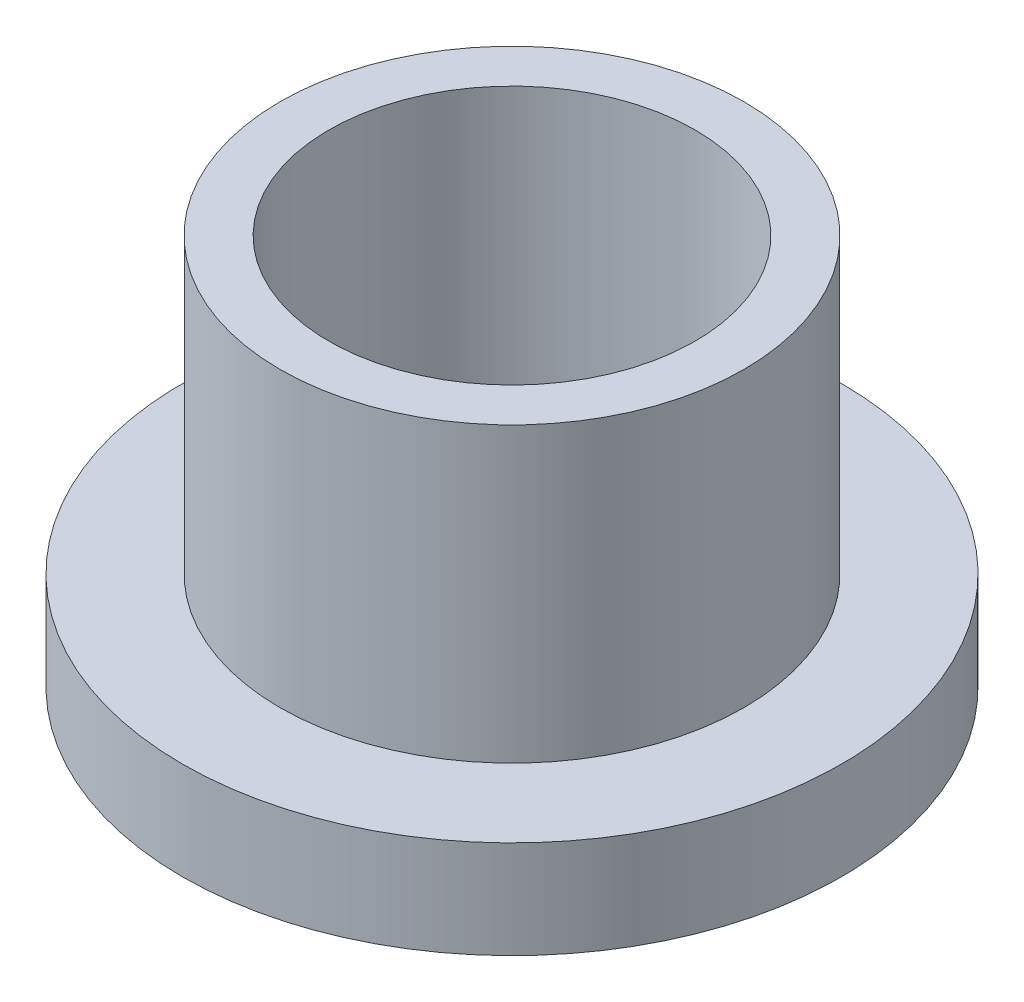
ISO-10303-21;
HEADER;
FILE_DESCRIPTION(('STEP AP214'),'2;1');
FILE_NAME('part.step','',(''),(''),'','','');
FILE_SCHEMA(('AUTOMOTIVE_DESIGN { 1 0 10303 214 1 1 1 1 }'));
ENDSEC;
DATA;
#1=APPLICATION_CONTEXT('core data for automotive mechanical design processes');
#2=APPLICATION_PROTOCOL_DEFINITION('international standard','automotive_design',2000,#1);
#3=PRODUCT_CONTEXT('',#1,'mechanical');
#4=PRODUCT('Part','Part','',(#3));
#5=PRODUCT_RELATED_PRODUCT_CATEGORY('part','',(#4));
#6=PRODUCT_DEFINITION_FORMATION('','',#4);
#7=PRODUCT_DEFINITION_CONTEXT('part definition',#1,'design');
#8=PRODUCT_DEFINITION('design','',#6,#7);
#9=PRODUCT_DEFINITION_SHAPE('','',#8);
#10=(LENGTH_UNIT() NAMED_UNIT(*) SI_UNIT(.MILLI.,.METRE.));
#11=(NAMED_UNIT(*) PLANE_ANGLE_UNIT() SI_UNIT($,.RADIAN.));
#12=(NAMED_UNIT(*) SI_UNIT($,.STERADIAN.) SOLID_ANGLE_UNIT());
#13=UNCERTAINTY_MEASURE_WITH_UNIT(LENGTH_MEASURE(1.E-05),#10,'distance_accuracy_value','');
#14=(GEOMETRIC_REPRESENTATION_CONTEXT(3) GLOBAL_UNCERTAINTY_ASSIGNED_CONTEXT((#13)) GLOBAL_UNIT_ASSIGNED_CONTEXT((#10,
#11,#12)) REPRESENTATION_CONTEXT('',''));
#15=CARTESIAN_POINT('',(0.,0.,0.));
#16=DIRECTION('',(0.,0.,1.));
#17=DIRECTION('',(1.,0.,0.));
#18=AXIS2_PLACEMENT_3D('',#15,#16,#17);
#19=CARTESIAN_POINT('',(0.,0.,0.));
#20=DIRECTION('',(0.,-1.,0.));
#21=DIRECTION('',(0.,0.,-1.));
#22=AXIS2_PLACEMENT_3D('',#19,#20,#21);
#23=CYLINDRICAL_SURFACE('',#22,1.5);
#24=CARTESIAN_POINT('',(0.,0.200000000000002,0.));
#25=DIRECTION('',(0.,-1.,0.));
#26=DIRECTION('',(0.,0.,-1.));
#27=AXIS2_PLACEMENT_3D('',#24,#25,#26);
#28=CIRCLE('',#27,1.5);
#29=CARTESIAN_POINT('',(0.,0.200000000000002,-1.5));
#30=VERTEX_POINT('',#29);
#31=EDGE_CURVE('E54',#30,#30,#28,.T.);
#32=ORIENTED_EDGE('',*,*,#31,.T.);
#33=EDGE_LOOP('',(#32));
#34=FACE_BOUND('',#33,.T.);
#35=CARTESIAN_POINT('',(0.,3.2,0.));
#36=DIRECTION('',(0.,-1.,0.));
#37=DIRECTION('',(0.,0.,-1.));
#38=AXIS2_PLACEMENT_3D('',#35,#36,#37);
#39=CIRCLE('',#38,1.5);
#40=CARTESIAN_POINT('',(0.,3.2,-1.5));
#41=VERTEX_POINT('',#40);
#42=EDGE_CURVE('E78',#41,#41,#39,.T.);
#43=ORIENTED_EDGE('',*,*,#42,.F.);
#44=EDGE_LOOP('',(#43));
#45=FACE_BOUND('',#44,.T.);
#46=ADVANCED_FACE('F45',(#34,#45),#23,.F.);
#47=CARTESIAN_POINT('',(1.5,0.,0.));
#48=DIRECTION('',(0.,-1.,0.));
#49=DIRECTION('',(0.,0.,-1.));
#50=AXIS2_PLACEMENT_3D('',#47,#48,#49);
#51=PLANE('',#50);
#52=CARTESIAN_POINT('',(0.,0.,0.));
#53=DIRECTION('',(0.,-1.,0.));
#54=DIRECTION('',(0.,0.,-1.));
#55=AXIS2_PLACEMENT_3D('',#52,#53,#54);
#56=CIRCLE('',#55,1.7);
#57=CARTESIAN_POINT('',(0.,0.,-1.7));
#58=VERTEX_POINT('',#57);
#59=EDGE_CURVE('E10',#58,#58,#56,.F.);
#60=ORIENTED_EDGE('',*,*,#59,.T.);
#61=EDGE_LOOP('',(#60));
#62=FACE_BOUND('',#61,.T.);
#63=CARTESIAN_POINT('',(0.,0.,0.));
#64=DIRECTION('',(0.,-1.,0.));
#65=DIRECTION('',(0.,0.,-1.));
#66=AXIS2_PLACEMENT_3D('',#63,#64,#65);
#67=CIRCLE('',#66,2.7);
#68=CARTESIAN_POINT('',(0.,0.,-2.7));
#69=VERTEX_POINT('',#68);
#70=EDGE_CURVE('E59',#69,#69,#67,.T.);
#71=ORIENTED_EDGE('',*,*,#70,.T.);
#72=EDGE_LOOP('',(#71));
#73=FACE_BOUND('',#72,.T.);
#74=ADVANCED_FACE('F87',(#62,#73),#51,.T.);
#75=CARTESIAN_POINT('',(0.,0.,0.));
#76=DIRECTION('',(0.,-1.,0.));
#77=DIRECTION('',(0.,0.,-1.));
#78=AXIS2_PLACEMENT_3D('',#75,#76,#77);
#79=CYLINDRICAL_SURFACE('',#78,2.7);
#80=CARTESIAN_POINT('',(0.,0.8,0.));
#81=DIRECTION('',(0.,-1.,0.));
#82=DIRECTION('',(0.,0.,-1.));
#83=AXIS2_PLACEMENT_3D('',#80,#81,#82);
#84=CIRCLE('',#83,2.7);
#85=CARTESIAN_POINT('',(0.,0.8,-2.7));
#86=VERTEX_POINT('',#85);
#87=EDGE_CURVE('E64',#86,#86,#84,.T.);
#88=ORIENTED_EDGE('',*,*,#87,.T.);
#89=EDGE_LOOP('',(#88));
#90=FACE_BOUND('',#89,.T.);
#91=ORIENTED_EDGE('',*,*,#70,.F.);
#92=EDGE_LOOP('',(#91));
#93=FACE_BOUND('',#92,.T.);
#94=ADVANCED_FACE('F92',(#90,#93),#79,.T.);
#95=CARTESIAN_POINT('',(2.7,0.8,0.));
#96=DIRECTION('',(0.,1.,0.));
#97=DIRECTION('',(0.,0.,1.));
#98=AXIS2_PLACEMENT_3D('',#95,#96,#97);
#99=PLANE('',#98);
#100=CARTESIAN_POINT('',(0.,0.799999999999999,0.));
#101=DIRECTION('',(0.,-1.,0.));
#102=DIRECTION('',(0.,0.,-1.));
#103=AXIS2_PLACEMENT_3D('',#100,#101,#102);
#104=CIRCLE('',#103,1.9);
#105=CARTESIAN_POINT('',(0.,0.799999999999999,-1.9));
#106=VERTEX_POINT('',#105);
#107=EDGE_CURVE('E70',#106,#106,#104,.T.);
#108=ORIENTED_EDGE('',*,*,#107,.T.);
#109=EDGE_LOOP('',(#108));
#110=FACE_BOUND('',#109,.T.);
#111=ORIENTED_EDGE('',*,*,#87,.F.);
#112=EDGE_LOOP('',(#111));
#113=FACE_BOUND('',#112,.T.);
#114=ADVANCED_FACE('F97',(#110,#113),#99,.T.);
#115=CARTESIAN_POINT('',(0.,0.,0.));
#116=DIRECTION('',(0.,-1.,0.));
#117=DIRECTION('',(0.,0.,-1.));
#118=AXIS2_PLACEMENT_3D('',#115,#116,#117);
#119=CYLINDRICAL_SURFACE('',#118,1.9);
#120=CARTESIAN_POINT('',(0.,3.2,0.));
#121=DIRECTION('',(0.,-1.,0.));
#122=DIRECTION('',(0.,0.,-1.));
#123=AXIS2_PLACEMENT_3D('',#120,#121,#122);
#124=CIRCLE('',#123,1.9);
#125=CARTESIAN_POINT('',(0.,3.2,-1.9));
#126=VERTEX_POINT('',#125);
#127=EDGE_CURVE('E74',#126,#126,#124,.T.);
#128=ORIENTED_EDGE('',*,*,#127,.T.);
#129=EDGE_LOOP('',(#128));
#130=FACE_BOUND('',#129,.T.);
#131=ORIENTED_EDGE('',*,*,#107,.F.);
#132=EDGE_LOOP('',(#131));
#133=FACE_BOUND('',#132,.T.);
#134=ADVANCED_FACE('F101',(#130,#133),#119,.T.);
#135=CARTESIAN_POINT('',(1.9,3.2,0.));
#136=DIRECTION('',(0.,1.,0.));
#137=DIRECTION('',(0.,0.,1.));
#138=AXIS2_PLACEMENT_3D('',#135,#136,#137);
#139=PLANE('',#138);
#140=ORIENTED_EDGE('',*,*,#42,.T.);
#141=EDGE_LOOP('',(#140));
#142=FACE_BOUND('',#141,.T.);
#143=ORIENTED_EDGE('',*,*,#127,.F.);
#144=EDGE_LOOP('',(#143));
#145=FACE_BOUND('',#144,.T.);
#146=ADVANCED_FACE('F83',(#142,#145),#139,.T.);
#147=CARTESIAN_POINT('',(0.,0.200000000000002,0.));
#148=DIRECTION('',(0.,-1.,0.));
#149=DIRECTION('',(0.,0.,-1.));
#150=AXIS2_PLACEMENT_3D('',#147,#148,#149);
#151=CONICAL_SURFACE('',#150,1.5,0.785398163397449);
#152=ORIENTED_EDGE('',*,*,#59,.F.);
#153=EDGE_LOOP('',(#152));
#154=FACE_BOUND('',#153,.T.);
#155=ORIENTED_EDGE('',*,*,#31,.F.);
#156=EDGE_LOOP('',(#155));
#157=FACE_BOUND('',#156,.T.);
#158=ADVANCED_FACE('F48',(#154,#157),#151,.F.);
#159=CLOSED_SHELL('',(#46,#74,#94,#114,#134,#146,#158));
#160=MANIFOLD_SOLID_BREP('B2',#159);
#161=ADVANCED_BREP_SHAPE_REPRESENTATION('',(#18,#160),#14);
#162=SHAPE_DEFINITION_REPRESENTATION(#9,#161);
ENDSEC;
END-ISO-10303-21;
